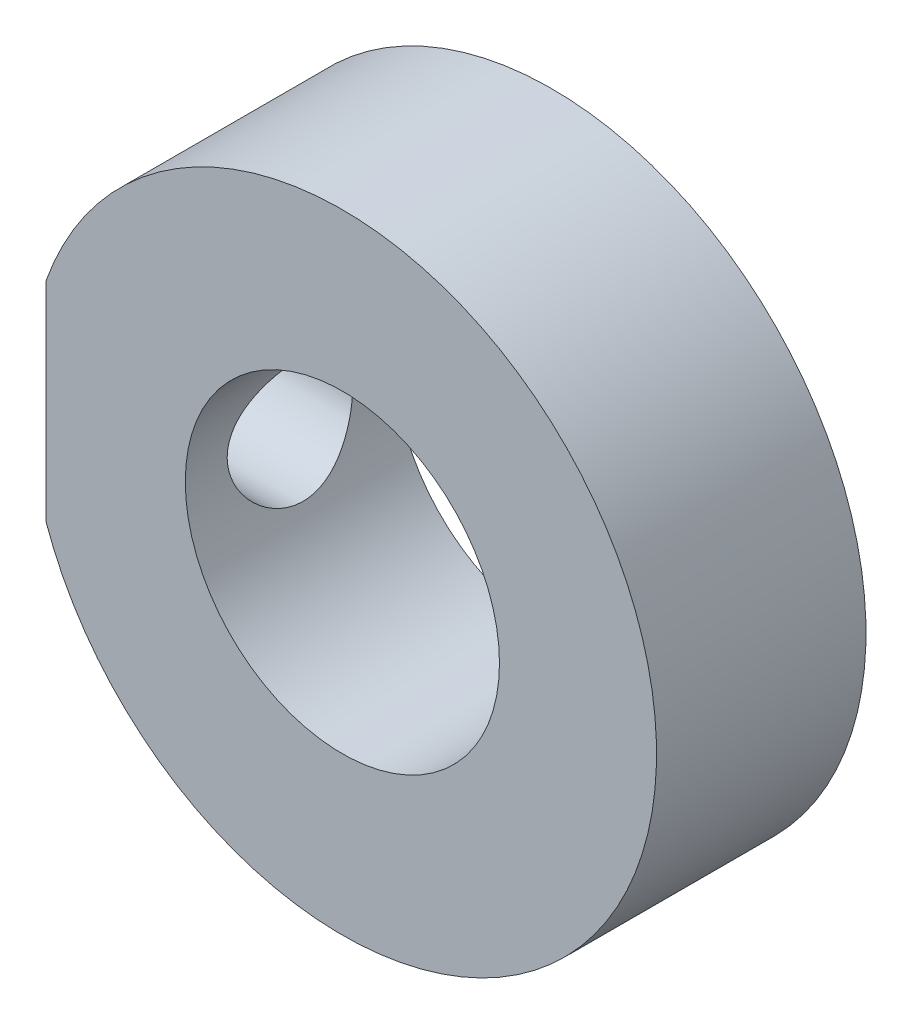
ISO-10303-21;
HEADER;
FILE_DESCRIPTION(('STEP AP214'),'2;1');
FILE_NAME('part.step','',(''),(''),'','','');
FILE_SCHEMA(('AUTOMOTIVE_DESIGN { 1 0 10303 214 1 1 1 1 }'));
ENDSEC;
DATA;
#1=APPLICATION_CONTEXT('core data for automotive mechanical design processes');
#2=APPLICATION_PROTOCOL_DEFINITION('international standard','automotive_design',2000,#1);
#3=PRODUCT_CONTEXT('',#1,'mechanical');
#4=PRODUCT('Part','Part','',(#3));
#5=PRODUCT_RELATED_PRODUCT_CATEGORY('part','',(#4));
#6=PRODUCT_DEFINITION_FORMATION('','',#4);
#7=PRODUCT_DEFINITION_CONTEXT('part definition',#1,'design');
#8=PRODUCT_DEFINITION('design','',#6,#7);
#9=PRODUCT_DEFINITION_SHAPE('','',#8);
#10=(LENGTH_UNIT() NAMED_UNIT(*) SI_UNIT(.MILLI.,.METRE.));
#11=(NAMED_UNIT(*) PLANE_ANGLE_UNIT() SI_UNIT($,.RADIAN.));
#12=(NAMED_UNIT(*) SI_UNIT($,.STERADIAN.) SOLID_ANGLE_UNIT());
#13=UNCERTAINTY_MEASURE_WITH_UNIT(LENGTH_MEASURE(1.E-05),#10,'distance_accuracy_value','');
#14=(GEOMETRIC_REPRESENTATION_CONTEXT(3) GLOBAL_UNCERTAINTY_ASSIGNED_CONTEXT((#13)) GLOBAL_UNIT_ASSIGNED_CONTEXT((#10,
#11,#12)) REPRESENTATION_CONTEXT('',''));
#15=CARTESIAN_POINT('',(0.,0.,0.));
#16=DIRECTION('',(0.,0.,1.));
#17=DIRECTION('',(1.,0.,0.));
#18=AXIS2_PLACEMENT_3D('',#15,#16,#17);
#19=CARTESIAN_POINT('',(0.,0.,5.));
#20=DIRECTION('',(0.,0.,1.));
#21=DIRECTION('',(1.,0.,0.));
#22=AXIS2_PLACEMENT_3D('',#19,#20,#21);
#23=PLANE('',#22);
#24=DIRECTION('',(0.,1.,0.));
#25=VECTOR('',#24,1.);
#26=CARTESIAN_POINT('',(-14.142135623731,5.,5.));
#27=LINE('',#26,#25);
#28=CARTESIAN_POINT('',(-14.142135623731,-5.,5.));
#29=VERTEX_POINT('',#28);
#30=CARTESIAN_POINT('',(-14.142135623731,5.,5.));
#31=VERTEX_POINT('',#30);
#32=EDGE_CURVE('E48',#29,#31,#27,.T.);
#33=ORIENTED_EDGE('',*,*,#32,.F.);
#34=CARTESIAN_POINT('',(0.,0.,5.));
#35=DIRECTION('',(0.,0.,1.));
#36=DIRECTION('',(1.,0.,0.));
#37=AXIS2_PLACEMENT_3D('',#34,#35,#36);
#38=CIRCLE('',#37,15.);
#39=EDGE_CURVE('E11',#29,#31,#38,.T.);
#40=ORIENTED_EDGE('',*,*,#39,.T.);
#41=EDGE_LOOP('',(#33,#40));
#42=FACE_BOUND('',#41,.T.);
#43=CARTESIAN_POINT('',(0.,0.,5.));
#44=DIRECTION('',(0.,0.,1.));
#45=DIRECTION('',(1.,0.,0.));
#46=AXIS2_PLACEMENT_3D('',#43,#44,#45);
#47=CIRCLE('',#46,7.5);
#48=CARTESIAN_POINT('',(7.5,0.,5.));
#49=VERTEX_POINT('',#48);
#50=EDGE_CURVE('E73',#49,#49,#47,.T.);
#51=ORIENTED_EDGE('',*,*,#50,.F.);
#52=EDGE_LOOP('',(#51));
#53=FACE_BOUND('',#52,.T.);
#54=ADVANCED_FACE('F33',(#42,#53),#23,.T.);
#55=CARTESIAN_POINT('',(0.,0.,-5.));
#56=DIRECTION('',(0.,0.,1.));
#57=DIRECTION('',(1.,0.,0.));
#58=AXIS2_PLACEMENT_3D('',#55,#56,#57);
#59=PLANE('',#58);
#60=CARTESIAN_POINT('',(0.,0.,-5.));
#61=DIRECTION('',(0.,0.,1.));
#62=DIRECTION('',(1.,0.,0.));
#63=AXIS2_PLACEMENT_3D('',#60,#61,#62);
#64=CIRCLE('',#63,15.);
#65=CARTESIAN_POINT('',(-14.142135623731,-5.,-5.));
#66=VERTEX_POINT('',#65);
#67=CARTESIAN_POINT('',(-14.142135623731,5.,-5.));
#68=VERTEX_POINT('',#67);
#69=EDGE_CURVE('E37',#66,#68,#64,.T.);
#70=ORIENTED_EDGE('',*,*,#69,.F.);
#71=DIRECTION('',(0.,1.,0.));
#72=VECTOR('',#71,1.);
#73=CARTESIAN_POINT('',(-14.142135623731,5.,-5.));
#74=LINE('',#73,#72);
#75=EDGE_CURVE('E60',#66,#68,#74,.T.);
#76=ORIENTED_EDGE('',*,*,#75,.T.);
#77=EDGE_LOOP('',(#70,#76));
#78=FACE_BOUND('',#77,.T.);
#79=CARTESIAN_POINT('',(0.,0.,-5.));
#80=DIRECTION('',(0.,0.,1.));
#81=DIRECTION('',(1.,0.,0.));
#82=AXIS2_PLACEMENT_3D('',#79,#80,#81);
#83=CIRCLE('',#82,7.5);
#84=CARTESIAN_POINT('',(7.5,0.,-5.));
#85=VERTEX_POINT('',#84);
#86=EDGE_CURVE('E70',#85,#85,#83,.T.);
#87=ORIENTED_EDGE('',*,*,#86,.T.);
#88=EDGE_LOOP('',(#87));
#89=FACE_BOUND('',#88,.T.);
#90=ADVANCED_FACE('F83',(#78,#89),#59,.F.);
#91=CARTESIAN_POINT('',(0.,0.,5.));
#92=DIRECTION('',(0.,0.,-1.));
#93=DIRECTION('',(-1.,0.,0.));
#94=AXIS2_PLACEMENT_3D('',#91,#92,#93);
#95=CYLINDRICAL_SURFACE('',#94,15.);
#96=ORIENTED_EDGE('',*,*,#39,.F.);
#97=DIRECTION('',(0.,0.,1.));
#98=VECTOR('',#97,1.);
#99=CARTESIAN_POINT('',(-14.142135623731,-5.,-5.));
#100=LINE('',#99,#98);
#101=EDGE_CURVE('E58',#66,#29,#100,.T.);
#102=ORIENTED_EDGE('',*,*,#101,.F.);
#103=ORIENTED_EDGE('',*,*,#69,.T.);
#104=DIRECTION('',(0.,0.,1.));
#105=VECTOR('',#104,1.);
#106=CARTESIAN_POINT('',(-14.142135623731,5.,-5.));
#107=LINE('',#106,#105);
#108=EDGE_CURVE('E53',#68,#31,#107,.T.);
#109=ORIENTED_EDGE('',*,*,#108,.T.);
#110=EDGE_LOOP('',(#96,#102,#103,#109));
#111=FACE_BOUND('',#110,.T.);
#112=ADVANCED_FACE('F35',(#111),#95,.T.);
#113=CARTESIAN_POINT('',(0.,0.,5.));
#114=DIRECTION('',(0.,0.,-1.));
#115=DIRECTION('',(-1.,0.,0.));
#116=AXIS2_PLACEMENT_3D('',#113,#114,#115);
#117=CYLINDRICAL_SURFACE('',#116,7.5);
#118=CARTESIAN_POINT('',(-7.5,0.,3.));
#119=CARTESIAN_POINT('',(-7.49999888970472,0.0806632009395357,2.9999983890229));
#120=CARTESIAN_POINT('',(-7.4986936895007,0.161354413498373,2.99674011548));
#121=CARTESIAN_POINT('',(-7.49351186176526,0.322146094522253,2.9837470954671));
#122=CARTESIAN_POINT('',(-7.48963361174618,0.402246157981983,2.97400826254011));
#123=CARTESIAN_POINT('',(-7.47424634808757,0.641096781067452,2.9351288598822));
#124=CARTESIAN_POINT('',(-7.45898522266242,0.798158082521719,2.89632569245522));
#125=CARTESIAN_POINT('',(-7.42011459126984,1.10247033899881,2.79468577218911));
#126=CARTESIAN_POINT('',(-7.39653243529675,1.24975157753076,2.73192770096983));
#127=CARTESIAN_POINT('',(-7.34334877224069,1.53159737405797,2.58447126970495));
#128=CARTESIAN_POINT('',(-7.31374935540466,1.66616632427491,2.49978052573423));
#129=CARTESIAN_POINT('',(-7.24996340359365,1.92525452632722,2.30664674369764));
#130=CARTESIAN_POINT('',(-7.2156344837394,2.04909421803168,2.19734001336868));
#131=CARTESIAN_POINT('',(-7.14690862377684,2.27726169757605,1.95989999705686));
#132=CARTESIAN_POINT('',(-7.11251165865921,2.38157993941976,1.8317575548035));
#133=CARTESIAN_POINT('',(-7.04584188546733,2.5723120820679,1.55335789398784));
#134=CARTESIAN_POINT('',(-7.01373174174385,2.65772253361338,1.40237027079118));
#135=CARTESIAN_POINT('',(-6.95750470553339,2.80163201676496,1.08669540254387));
#136=CARTESIAN_POINT('',(-6.93338401809298,2.86014383023324,0.922014708274903));
#137=CARTESIAN_POINT('',(-6.8973953654561,2.94584825055478,0.591431499566553));
#138=CARTESIAN_POINT('',(-6.88502130539265,2.974340952837,0.425923146617134));
#139=CARTESIAN_POINT('',(-6.87246006067861,3.00325943833354,0.0920475025576351));
#140=CARTESIAN_POINT('',(-6.87226688315068,3.00369902341366,-0.0763183419086432));
#141=CARTESIAN_POINT('',(-6.88365750391268,2.97748405223855,-0.398635007225333));
#142=CARTESIAN_POINT('',(-6.89442262441713,2.95271297167583,-0.552773571723855));
#143=CARTESIAN_POINT('',(-6.92514281294201,2.87992032013237,-0.85448933411311));
#144=CARTESIAN_POINT('',(-6.94509948450627,2.83189469212407,-1.00206538218921));
#145=CARTESIAN_POINT('',(-6.99239227665171,2.71304209891512,-1.29002675426026));
#146=CARTESIAN_POINT('',(-7.01987068929879,2.64176979349676,-1.43020385857295));
#147=CARTESIAN_POINT('',(-7.07907174576133,2.47875969107453,-1.69712372455143));
#148=CARTESIAN_POINT('',(-7.11079598182861,2.38701420764467,-1.82386141410673));
#149=CARTESIAN_POINT('',(-7.17790105116005,2.17732589918876,-2.07061459320028));
#150=CARTESIAN_POINT('',(-7.21337497464924,2.05790619445786,-2.1893530941683));
#151=CARTESIAN_POINT('',(-7.28189737436726,1.80047164114338,-2.40552671700379));
#152=CARTESIAN_POINT('',(-7.31494536667799,1.66245309800114,-2.50295759611564));
#153=CARTESIAN_POINT('',(-7.37572021897015,1.36811647890929,-2.67542617112355));
#154=CARTESIAN_POINT('',(-7.40332905143173,1.21149073701986,-2.74998342179553));
#155=CARTESIAN_POINT('',(-7.44922242493087,0.886535648224186,-2.87125179161714));
#156=CARTESIAN_POINT('',(-7.4675117019356,0.718212295274481,-2.91797705633613));
#157=CARTESIAN_POINT('',(-7.49184209260378,0.385343831411761,-2.97967244312955));
#158=CARTESIAN_POINT('',(-7.49854418750274,0.221164940978295,-2.99635868138034));
#159=CARTESIAN_POINT('',(-7.50102717765943,-0.107767964711716,-3.00256965079292));
#160=CARTESIAN_POINT('',(-7.49681090373437,-0.272521819835822,-2.99210142232125));
#161=CARTESIAN_POINT('',(-7.4783635059563,-0.59014910868304,-2.94556237117203));
#162=CARTESIAN_POINT('',(-7.46459087018283,-0.743223737663436,-2.91066302947361));
#163=CARTESIAN_POINT('',(-7.42889162108252,-1.04120314209094,-2.81784643753521));
#164=CARTESIAN_POINT('',(-7.40696396034803,-1.18610686533642,-2.7599262304967));
#165=CARTESIAN_POINT('',(-7.3562489215621,-1.46861817872592,-2.62082259048036));
#166=CARTESIAN_POINT('',(-7.32727223969677,-1.60586703413639,-2.53898179193637));
#167=CARTESIAN_POINT('',(-7.26560047118315,-1.86516538686655,-2.35508951414045));
#168=CARTESIAN_POINT('',(-7.23290389665513,-1.98720876112942,-2.25302993561203));
#169=CARTESIAN_POINT('',(-7.16467676457054,-2.2210845645563,-2.02369498057988));
#170=CARTESIAN_POINT('',(-7.12910162137139,-2.33171090075939,-1.89519968775731));
#171=CARTESIAN_POINT('',(-7.06112509376137,-2.53012679607026,-1.62083987546932));
#172=CARTESIAN_POINT('',(-7.02872423291408,-2.6179125918181,-1.47497249942789));
#173=CARTESIAN_POINT('',(-6.97071449859905,-2.76871125308743,-1.16780745817163));
#174=CARTESIAN_POINT('',(-6.94517446320966,-2.83147589251401,-1.00637400141696));
#175=CARTESIAN_POINT('',(-6.90485510223108,-2.92844432884615,-0.673899522192015));
#176=CARTESIAN_POINT('',(-6.89006783567176,-2.96266920524751,-0.502865690403397));
#177=CARTESIAN_POINT('',(-6.87407638928379,-2.9995734283829,-0.169308148152972));
#178=CARTESIAN_POINT('',(-6.87197131434659,-3.00434563234764,-0.00705774354923481));
#179=CARTESIAN_POINT('',(-6.87922254127235,-2.98770473002408,0.315817289508825));
#180=CARTESIAN_POINT('',(-6.88857738776018,-2.96629494876877,0.476442121794097));
#181=CARTESIAN_POINT('',(-6.91689973341124,-2.89960708102334,0.784998274274974));
#182=CARTESIAN_POINT('',(-6.93547246725062,-2.85530635681061,0.933180373161244));
#183=CARTESIAN_POINT('',(-6.97986002865438,-2.7450080562502,1.22006798291911));
#184=CARTESIAN_POINT('',(-7.00567685597585,-2.67900448789151,1.35877086385317));
#185=CARTESIAN_POINT('',(-7.06347910401242,-2.52280960319953,1.63141427718623));
#186=CARTESIAN_POINT('',(-7.09573308125317,-2.43144976133989,1.76462742397581));
#187=CARTESIAN_POINT('',(-7.16195721907533,-2.2288364197758,2.01449055720097));
#188=CARTESIAN_POINT('',(-7.1959278947067,-2.1175769239766,2.13113553231325));
#189=CARTESIAN_POINT('',(-7.26440289511609,-1.86976526416226,2.35230196481483));
#190=CARTESIAN_POINT('',(-7.29879901943986,-1.73204093441049,2.45554705905594));
#191=CARTESIAN_POINT('',(-7.36200845178942,-1.43982353523661,2.63751446935513));
#192=CARTESIAN_POINT('',(-7.39081916114846,-1.28532271229705,2.71622538095622));
#193=CARTESIAN_POINT('',(-7.42714827886077,-1.04589046292377,2.81307350088879));
#194=CARTESIAN_POINT('',(-7.438042523706,-0.965550642326299,2.84165597012401));
#195=CARTESIAN_POINT('',(-7.45739623794253,-0.80247201519513,2.89193765829433));
#196=CARTESIAN_POINT('',(-7.46585684248286,-0.719734347003786,2.91364008684478));
#197=CARTESIAN_POINT('',(-7.48007543500346,-0.552707555877392,2.94988203096378));
#198=CARTESIAN_POINT('',(-7.48584027408325,-0.468422937872992,2.96443970913791));
#199=CARTESIAN_POINT('',(-7.49452509406316,-0.298814608941243,2.98630365279151));
#200=CARTESIAN_POINT('',(-7.49744709693401,-0.21349168031174,2.99361507225066));
#201=CARTESIAN_POINT('',(-7.49963590220856,-0.0853730051866022,2.99908952040527));
#202=CARTESIAN_POINT('',(-7.50000058761588,-0.0426904255930875,3.00000085259817));
#203=CARTESIAN_POINT('',(-7.5,0.,3.));
#204=B_SPLINE_CURVE_WITH_KNOTS('',3,(#118,#119,#120,#121,#122,#123,#124,#125,#126,#127,#128,
#129,#130,#131,#132,#133,#134,#135,#136,#137,#138,#139,#140,#141,#142,#143,#144,#145,#146,#147,
#148,#149,#150,#151,#152,#153,#154,#155,#156,#157,#158,#159,#160,#161,#162,#163,#164,#165,#166,
#167,#168,#169,#170,#171,#172,#173,#174,#175,#176,#177,#178,#179,#180,#181,#182,#183,#184,#185,
#186,#187,#188,#189,#190,#191,#192,#193,#194,#195,#196,#197,#198,#199,#200,#201,#202,#203),
.UNSPECIFIED.,.T.,.F.,(4,2,2,2,2,2,2,2,2,2,2,2,2,2,2,2,2,2,2,2,2,2,2,2,2,2,2,2,2,2,2,2,2,2,2,2,
2,2,2,2,2,2,4),(0.,0.241952995066616,0.484058703589861,0.968979675762157,1.45232140795763,
1.93549552527002,2.43941494725621,2.94358014576643,3.47018310403851,3.99653556852428,
4.49901580138268,5.00124881685757,5.46852914780512,5.93589103065597,6.4127911162975,
6.88987055088801,7.40382945961362,7.91789061441125,8.44210791925735,8.96605856352212,
9.45899198973537,9.9517976253665,10.4224610552807,10.8931849567222,11.3783069227892,
11.8636236142998,12.3809813411815,12.8984242574715,13.4208798989277,13.9429493115043,
14.4274493227065,14.9118878102609,15.3771690000468,15.8425787588927,16.3346362426656,
16.8268422420412,17.3509605748228,17.8753221764233,18.1329380344125,18.3904335342851,
18.6472710222664,18.9039257004315,19.0319776028183),.UNSPECIFIED.);
#205=CARTESIAN_POINT('',(-7.5,0.,3.));
#206=VERTEX_POINT('',#205);
#207=EDGE_CURVE('E103',#206,#206,#204,.T.);
#208=ORIENTED_EDGE('',*,*,#207,.T.);
#209=EDGE_LOOP('',(#208));
#210=FACE_BOUND('',#209,.T.);
#211=ORIENTED_EDGE('',*,*,#50,.T.);
#212=EDGE_LOOP('',(#211));
#213=FACE_BOUND('',#212,.T.);
#214=ORIENTED_EDGE('',*,*,#86,.F.);
#215=EDGE_LOOP('',(#214));
#216=FACE_BOUND('',#215,.T.);
#217=ADVANCED_FACE('F80',(#210,#213,#216),#117,.F.);
#218=CARTESIAN_POINT('',(-14.142135623731,5.,-5.));
#219=DIRECTION('',(1.,0.,0.));
#220=DIRECTION('',(0.,0.,-1.));
#221=AXIS2_PLACEMENT_3D('',#218,#219,#220);
#222=PLANE('',#221);
#223=CARTESIAN_POINT('',(-14.142135623731,0.,0.));
#224=DIRECTION('',(-1.,0.,0.));
#225=DIRECTION('',(0.,0.,1.));
#226=AXIS2_PLACEMENT_3D('',#223,#224,#225);
#227=CIRCLE('',#226,3.);
#228=CARTESIAN_POINT('',(-14.142135623731,0.,3.));
#229=VERTEX_POINT('',#228);
#230=EDGE_CURVE('E68',#229,#229,#227,.T.);
#231=ORIENTED_EDGE('',*,*,#230,.F.);
#232=EDGE_LOOP('',(#231));
#233=FACE_BOUND('',#232,.T.);
#234=ORIENTED_EDGE('',*,*,#32,.T.);
#235=ORIENTED_EDGE('',*,*,#108,.F.);
#236=ORIENTED_EDGE('',*,*,#75,.F.);
#237=ORIENTED_EDGE('',*,*,#101,.T.);
#238=EDGE_LOOP('',(#234,#235,#236,#237));
#239=FACE_BOUND('',#238,.T.);
#240=ADVANCED_FACE('F59',(#233,#239),#222,.F.);
#241=CARTESIAN_POINT('',(15.001,0.,0.));
#242=DIRECTION('',(-1.,0.,0.));
#243=DIRECTION('',(0.,0.,1.));
#244=AXIS2_PLACEMENT_3D('',#241,#242,#243);
#245=CYLINDRICAL_SURFACE('',#244,3.);
#246=ORIENTED_EDGE('',*,*,#207,.F.);
#247=EDGE_LOOP('',(#246));
#248=FACE_BOUND('',#247,.T.);
#249=ORIENTED_EDGE('',*,*,#230,.T.);
#250=EDGE_LOOP('',(#249));
#251=FACE_BOUND('',#250,.T.);
#252=ADVANCED_FACE('F95',(#248,#251),#245,.F.);
#253=CLOSED_SHELL('',(#54,#90,#112,#217,#240,#252));
#254=MANIFOLD_SOLID_BREP('B2',#253);
#255=ADVANCED_BREP_SHAPE_REPRESENTATION('',(#18,#254),#14);
#256=SHAPE_DEFINITION_REPRESENTATION(#9,#255);
ENDSEC;
END-ISO-10303-21;
